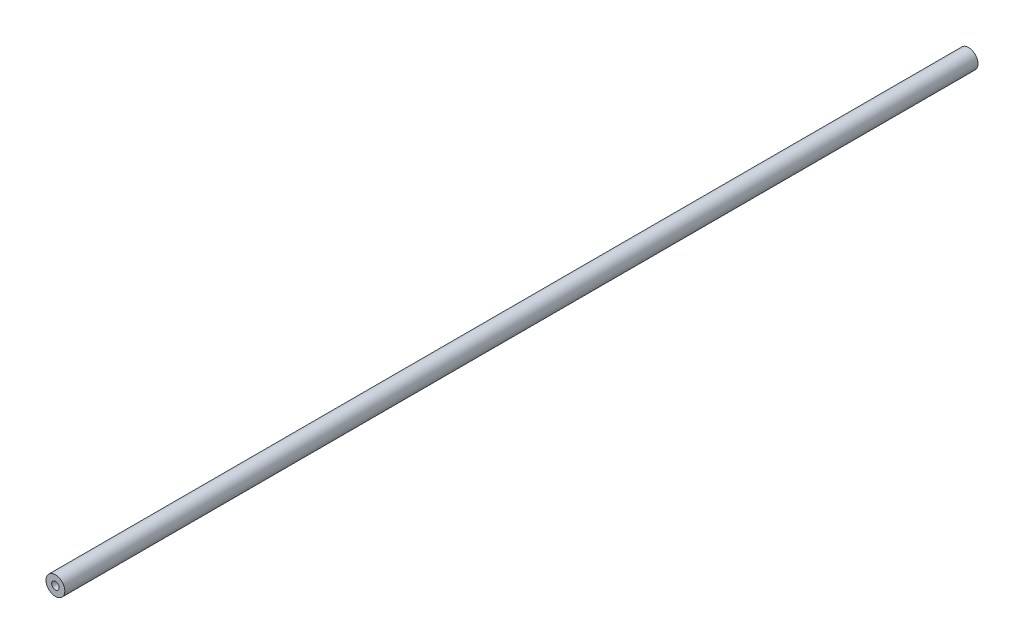
ISO-10303-21;
HEADER;
FILE_DESCRIPTION(('STEP AP214'),'2;1');
FILE_NAME('part.step','',(''),(''),'','','');
FILE_SCHEMA(('AUTOMOTIVE_DESIGN { 1 0 10303 214 1 1 1 1 }'));
ENDSEC;
DATA;
#1=APPLICATION_CONTEXT('core data for automotive mechanical design processes');
#2=APPLICATION_PROTOCOL_DEFINITION('international standard','automotive_design',2000,#1);
#3=PRODUCT_CONTEXT('',#1,'mechanical');
#4=PRODUCT('Part','Part','',(#3));
#5=PRODUCT_RELATED_PRODUCT_CATEGORY('part','',(#4));
#6=PRODUCT_DEFINITION_FORMATION('','',#4);
#7=PRODUCT_DEFINITION_CONTEXT('part definition',#1,'design');
#8=PRODUCT_DEFINITION('design','',#6,#7);
#9=PRODUCT_DEFINITION_SHAPE('','',#8);
#10=(LENGTH_UNIT() NAMED_UNIT(*) SI_UNIT(.MILLI.,.METRE.));
#11=(NAMED_UNIT(*) PLANE_ANGLE_UNIT() SI_UNIT($,.RADIAN.));
#12=(NAMED_UNIT(*) SI_UNIT($,.STERADIAN.) SOLID_ANGLE_UNIT());
#13=UNCERTAINTY_MEASURE_WITH_UNIT(LENGTH_MEASURE(1.E-05),#10,'distance_accuracy_value','');
#14=(GEOMETRIC_REPRESENTATION_CONTEXT(3) GLOBAL_UNCERTAINTY_ASSIGNED_CONTEXT((#13)) GLOBAL_UNIT_ASSIGNED_CONTEXT((#10,
#11,#12)) REPRESENTATION_CONTEXT('',''));
#15=CARTESIAN_POINT('',(0.,0.,0.));
#16=DIRECTION('',(0.,0.,1.));
#17=DIRECTION('',(1.,0.,0.));
#18=AXIS2_PLACEMENT_3D('',#15,#16,#17);
#19=CARTESIAN_POINT('',(0.,0.,307.975));
#20=DIRECTION('',(0.,0.,-1.));
#21=DIRECTION('',(-1.,0.,0.));
#22=AXIS2_PLACEMENT_3D('',#19,#20,#21);
#23=CYLINDRICAL_SURFACE('',#22,3.175);
#24=CARTESIAN_POINT('',(0.,0.,307.975));
#25=DIRECTION('',(0.,0.,1.));
#26=DIRECTION('',(1.,0.,0.));
#27=AXIS2_PLACEMENT_3D('',#24,#25,#26);
#28=CIRCLE('',#27,3.175);
#29=CARTESIAN_POINT('',(3.175,0.,307.975));
#30=VERTEX_POINT('',#29);
#31=EDGE_CURVE('E10',#30,#30,#28,.T.);
#32=ORIENTED_EDGE('',*,*,#31,.F.);
#33=EDGE_LOOP('',(#32));
#34=FACE_BOUND('',#33,.T.);
#35=CARTESIAN_POINT('',(0.,0.,0.));
#36=DIRECTION('',(0.,0.,1.));
#37=DIRECTION('',(1.,0.,0.));
#38=AXIS2_PLACEMENT_3D('',#35,#36,#37);
#39=CIRCLE('',#38,3.175);
#40=CARTESIAN_POINT('',(3.175,0.,0.));
#41=VERTEX_POINT('',#40);
#42=EDGE_CURVE('E39',#41,#41,#39,.T.);
#43=ORIENTED_EDGE('',*,*,#42,.T.);
#44=EDGE_LOOP('',(#43));
#45=FACE_BOUND('',#44,.T.);
#46=ADVANCED_FACE('F36',(#34,#45),#23,.T.);
#47=CARTESIAN_POINT('',(0.,0.,307.975));
#48=DIRECTION('',(0.,0.,1.));
#49=DIRECTION('',(1.,0.,0.));
#50=AXIS2_PLACEMENT_3D('',#47,#48,#49);
#51=PLANE('',#50);
#52=CARTESIAN_POINT('',(0.,0.,307.975));
#53=DIRECTION('',(0.,0.,1.));
#54=DIRECTION('',(1.,0.,0.));
#55=AXIS2_PLACEMENT_3D('',#52,#53,#54);
#56=CIRCLE('',#55,1.27);
#57=CARTESIAN_POINT('',(1.27,0.,307.975));
#58=VERTEX_POINT('',#57);
#59=EDGE_CURVE('E48',#58,#58,#56,.T.);
#60=ORIENTED_EDGE('',*,*,#59,.F.);
#61=EDGE_LOOP('',(#60));
#62=FACE_BOUND('',#61,.T.);
#63=ORIENTED_EDGE('',*,*,#31,.T.);
#64=EDGE_LOOP('',(#63));
#65=FACE_BOUND('',#64,.T.);
#66=ADVANCED_FACE('F63',(#62,#65),#51,.T.);
#67=CARTESIAN_POINT('',(0.,0.,0.));
#68=DIRECTION('',(0.,0.,1.));
#69=DIRECTION('',(1.,0.,0.));
#70=AXIS2_PLACEMENT_3D('',#67,#68,#69);
#71=PLANE('',#70);
#72=CARTESIAN_POINT('',(0.,0.,0.));
#73=DIRECTION('',(0.,0.,1.));
#74=DIRECTION('',(1.,0.,0.));
#75=AXIS2_PLACEMENT_3D('',#72,#73,#74);
#76=CIRCLE('',#75,1.27);
#77=CARTESIAN_POINT('',(1.27,0.,0.));
#78=VERTEX_POINT('',#77);
#79=EDGE_CURVE('E46',#78,#78,#76,.T.);
#80=ORIENTED_EDGE('',*,*,#79,.T.);
#81=EDGE_LOOP('',(#80));
#82=FACE_BOUND('',#81,.T.);
#83=ORIENTED_EDGE('',*,*,#42,.F.);
#84=EDGE_LOOP('',(#83));
#85=FACE_BOUND('',#84,.T.);
#86=ADVANCED_FACE('F54',(#82,#85),#71,.F.);
#87=CARTESIAN_POINT('',(0.,0.,0.));
#88=DIRECTION('',(0.,0.,1.));
#89=DIRECTION('',(1.,0.,0.));
#90=AXIS2_PLACEMENT_3D('',#87,#88,#89);
#91=CYLINDRICAL_SURFACE('',#90,1.27);
#92=ORIENTED_EDGE('',*,*,#79,.F.);
#93=EDGE_LOOP('',(#92));
#94=FACE_BOUND('',#93,.T.);
#95=ORIENTED_EDGE('',*,*,#59,.T.);
#96=EDGE_LOOP('',(#95));
#97=FACE_BOUND('',#96,.T.);
#98=ADVANCED_FACE('F57',(#94,#97),#91,.F.);
#99=CLOSED_SHELL('',(#46,#66,#86,#98));
#100=MANIFOLD_SOLID_BREP('B2',#99);
#101=ADVANCED_BREP_SHAPE_REPRESENTATION('',(#18,#100),#14);
#102=SHAPE_DEFINITION_REPRESENTATION(#9,#101);
ENDSEC;
END-ISO-10303-21;
